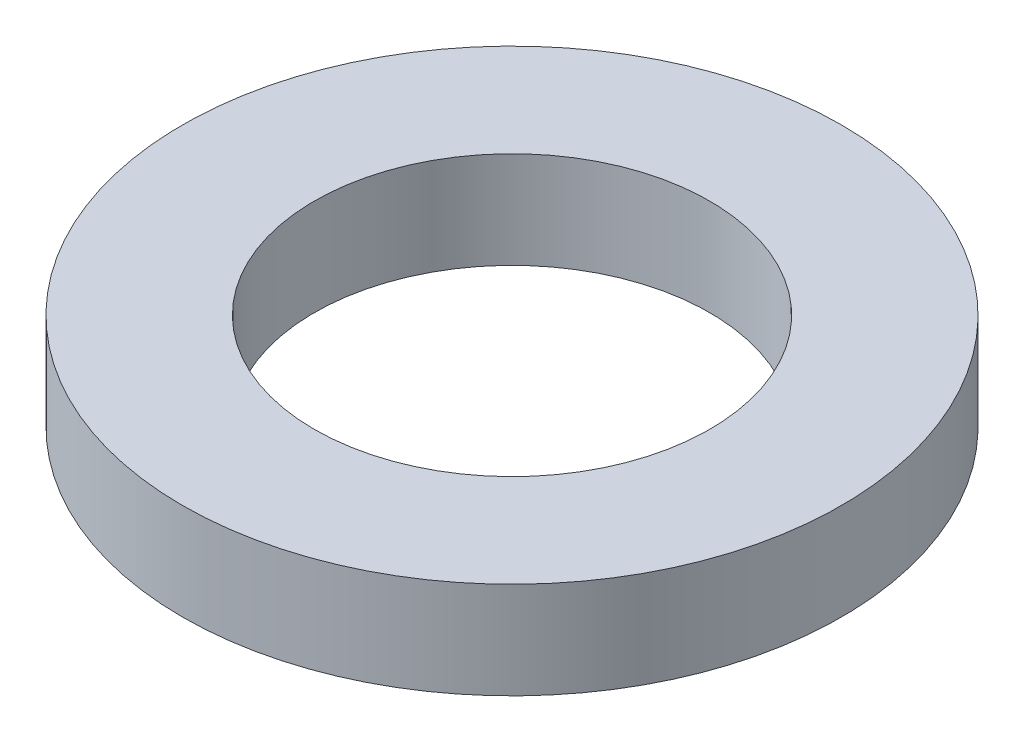
ISO-10303-21;
HEADER;
FILE_DESCRIPTION(('STEP AP214'),'2;1');
FILE_NAME('part.step','',(''),(''),'','','');
FILE_SCHEMA(('AUTOMOTIVE_DESIGN { 1 0 10303 214 1 1 1 1 }'));
ENDSEC;
DATA;
#1=APPLICATION_CONTEXT('core data for automotive mechanical design processes');
#2=APPLICATION_PROTOCOL_DEFINITION('international standard','automotive_design',2000,#1);
#3=PRODUCT_CONTEXT('',#1,'mechanical');
#4=PRODUCT('Part','Part','',(#3));
#5=PRODUCT_RELATED_PRODUCT_CATEGORY('part','',(#4));
#6=PRODUCT_DEFINITION_FORMATION('','',#4);
#7=PRODUCT_DEFINITION_CONTEXT('part definition',#1,'design');
#8=PRODUCT_DEFINITION('design','',#6,#7);
#9=PRODUCT_DEFINITION_SHAPE('','',#8);
#10=(LENGTH_UNIT() NAMED_UNIT(*) SI_UNIT(.MILLI.,.METRE.));
#11=(NAMED_UNIT(*) PLANE_ANGLE_UNIT() SI_UNIT($,.RADIAN.));
#12=(NAMED_UNIT(*) SI_UNIT($,.STERADIAN.) SOLID_ANGLE_UNIT());
#13=UNCERTAINTY_MEASURE_WITH_UNIT(LENGTH_MEASURE(1.E-05),#10,'distance_accuracy_value','');
#14=(GEOMETRIC_REPRESENTATION_CONTEXT(3) GLOBAL_UNCERTAINTY_ASSIGNED_CONTEXT((#13)) GLOBAL_UNIT_ASSIGNED_CONTEXT((#10,
#11,#12)) REPRESENTATION_CONTEXT('',''));
#15=CARTESIAN_POINT('',(0.,0.,0.));
#16=DIRECTION('',(0.,0.,1.));
#17=DIRECTION('',(1.,0.,0.));
#18=AXIS2_PLACEMENT_3D('',#15,#16,#17);
#19=CARTESIAN_POINT('',(0.,11.,0.));
#20=DIRECTION('',(0.,-1.,0.));
#21=DIRECTION('',(0.,0.,-1.));
#22=AXIS2_PLACEMENT_3D('',#19,#20,#21);
#23=CYLINDRICAL_SURFACE('',#22,37.5);
#24=CARTESIAN_POINT('',(0.,11.,0.));
#25=DIRECTION('',(0.,1.,0.));
#26=DIRECTION('',(0.,0.,1.));
#27=AXIS2_PLACEMENT_3D('',#24,#25,#26);
#28=CIRCLE('',#27,37.5);
#29=CARTESIAN_POINT('',(0.,11.,37.5));
#30=VERTEX_POINT('',#29);
#31=EDGE_CURVE('E10',#30,#30,#28,.T.);
#32=ORIENTED_EDGE('',*,*,#31,.F.);
#33=EDGE_LOOP('',(#32));
#34=FACE_BOUND('',#33,.T.);
#35=CARTESIAN_POINT('',(0.,0.,0.));
#36=DIRECTION('',(0.,1.,0.));
#37=DIRECTION('',(0.,0.,1.));
#38=AXIS2_PLACEMENT_3D('',#35,#36,#37);
#39=CIRCLE('',#38,37.5);
#40=CARTESIAN_POINT('',(0.,0.,37.5));
#41=VERTEX_POINT('',#40);
#42=EDGE_CURVE('E37',#41,#41,#39,.T.);
#43=ORIENTED_EDGE('',*,*,#42,.T.);
#44=EDGE_LOOP('',(#43));
#45=FACE_BOUND('',#44,.T.);
#46=ADVANCED_FACE('F40',(#34,#45),#23,.T.);
#47=CARTESIAN_POINT('',(0.,11.,0.));
#48=DIRECTION('',(0.,1.,0.));
#49=DIRECTION('',(0.,0.,1.));
#50=AXIS2_PLACEMENT_3D('',#47,#48,#49);
#51=PLANE('',#50);
#52=CARTESIAN_POINT('',(0.,11.,0.));
#53=DIRECTION('',(0.,1.,0.));
#54=DIRECTION('',(0.,0.,1.));
#55=AXIS2_PLACEMENT_3D('',#52,#53,#54);
#56=CIRCLE('',#55,22.5);
#57=CARTESIAN_POINT('',(0.,11.,22.5));
#58=VERTEX_POINT('',#57);
#59=EDGE_CURVE('E50',#58,#58,#56,.T.);
#60=ORIENTED_EDGE('',*,*,#59,.F.);
#61=EDGE_LOOP('',(#60));
#62=FACE_BOUND('',#61,.T.);
#63=ORIENTED_EDGE('',*,*,#31,.T.);
#64=EDGE_LOOP('',(#63));
#65=FACE_BOUND('',#64,.T.);
#66=ADVANCED_FACE('F59',(#62,#65),#51,.T.);
#67=CARTESIAN_POINT('',(0.,0.,0.));
#68=DIRECTION('',(0.,1.,0.));
#69=DIRECTION('',(0.,0.,1.));
#70=AXIS2_PLACEMENT_3D('',#67,#68,#69);
#71=PLANE('',#70);
#72=CARTESIAN_POINT('',(0.,0.,0.));
#73=DIRECTION('',(0.,1.,0.));
#74=DIRECTION('',(0.,0.,1.));
#75=AXIS2_PLACEMENT_3D('',#72,#73,#74);
#76=CIRCLE('',#75,22.5);
#77=CARTESIAN_POINT('',(0.,0.,22.5));
#78=VERTEX_POINT('',#77);
#79=EDGE_CURVE('E47',#78,#78,#76,.T.);
#80=ORIENTED_EDGE('',*,*,#79,.T.);
#81=EDGE_LOOP('',(#80));
#82=FACE_BOUND('',#81,.T.);
#83=ORIENTED_EDGE('',*,*,#42,.F.);
#84=EDGE_LOOP('',(#83));
#85=FACE_BOUND('',#84,.T.);
#86=ADVANCED_FACE('F58',(#82,#85),#71,.F.);
#87=CARTESIAN_POINT('',(0.,11.,0.));
#88=DIRECTION('',(0.,-1.,0.));
#89=DIRECTION('',(0.,0.,-1.));
#90=AXIS2_PLACEMENT_3D('',#87,#88,#89);
#91=CYLINDRICAL_SURFACE('',#90,22.5);
#92=ORIENTED_EDGE('',*,*,#59,.T.);
#93=EDGE_LOOP('',(#92));
#94=FACE_BOUND('',#93,.T.);
#95=ORIENTED_EDGE('',*,*,#79,.F.);
#96=EDGE_LOOP('',(#95));
#97=FACE_BOUND('',#96,.T.);
#98=ADVANCED_FACE('F54',(#94,#97),#91,.F.);
#99=CLOSED_SHELL('',(#46,#66,#86,#98));
#100=MANIFOLD_SOLID_BREP('B2',#99);
#101=ADVANCED_BREP_SHAPE_REPRESENTATION('',(#18,#100),#14);
#102=SHAPE_DEFINITION_REPRESENTATION(#9,#101);
ENDSEC;
END-ISO-10303-21;
